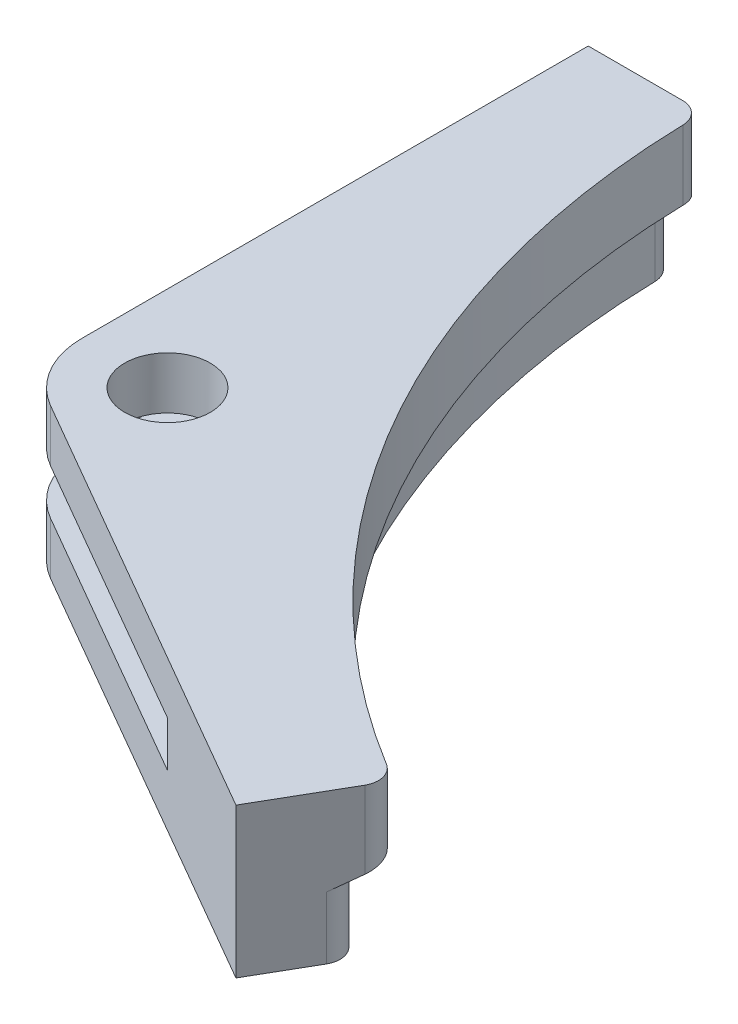
ISO-10303-21;
HEADER;
FILE_DESCRIPTION(('STEP AP214'),'2;1');
FILE_NAME('part.step','',(''),(''),'','','');
FILE_SCHEMA(('AUTOMOTIVE_DESIGN { 1 0 10303 214 1 1 1 1 }'));
ENDSEC;
DATA;
#1=APPLICATION_CONTEXT('core data for automotive mechanical design processes');
#2=APPLICATION_PROTOCOL_DEFINITION('international standard','automotive_design',2000,#1);
#3=PRODUCT_CONTEXT('',#1,'mechanical');
#4=PRODUCT('Part','Part','',(#3));
#5=PRODUCT_RELATED_PRODUCT_CATEGORY('part','',(#4));
#6=PRODUCT_DEFINITION_FORMATION('','',#4);
#7=PRODUCT_DEFINITION_CONTEXT('part definition',#1,'design');
#8=PRODUCT_DEFINITION('design','',#6,#7);
#9=PRODUCT_DEFINITION_SHAPE('','',#8);
#10=(LENGTH_UNIT() NAMED_UNIT(*) SI_UNIT(.MILLI.,.METRE.));
#11=(NAMED_UNIT(*) PLANE_ANGLE_UNIT() SI_UNIT($,.RADIAN.));
#12=(NAMED_UNIT(*) SI_UNIT($,.STERADIAN.) SOLID_ANGLE_UNIT());
#13=UNCERTAINTY_MEASURE_WITH_UNIT(LENGTH_MEASURE(1.E-05),#10,'distance_accuracy_value','');
#14=(GEOMETRIC_REPRESENTATION_CONTEXT(3) GLOBAL_UNCERTAINTY_ASSIGNED_CONTEXT((#13)) GLOBAL_UNIT_ASSIGNED_CONTEXT((#10,
#11,#12)) REPRESENTATION_CONTEXT('',''));
#15=CARTESIAN_POINT('',(0.,0.,0.));
#16=DIRECTION('',(0.,0.,1.));
#17=DIRECTION('',(1.,0.,0.));
#18=AXIS2_PLACEMENT_3D('',#15,#16,#17);
#19=CARTESIAN_POINT('',(8.00000000000001,-90.0000000000002,47.3427220735494));
#20=DIRECTION('',(0.,-1.,0.));
#21=DIRECTION('',(0.,0.,-1.));
#22=AXIS2_PLACEMENT_3D('',#19,#20,#21);
#23=CYLINDRICAL_SURFACE('',#22,8.);
#24=CARTESIAN_POINT('',(8.00000000000001,9.12500000000001,47.3427220735494));
#25=DIRECTION('',(0.,1.,0.));
#26=DIRECTION('',(-1.,0.,0.));
#27=AXIS2_PLACEMENT_3D('',#24,#25,#26);
#28=CIRCLE('',#27,8.);
#29=CARTESIAN_POINT('',(4.00000000000002,9.12500000000001,54.270925303825));
#30=VERTEX_POINT('',#29);
#31=CARTESIAN_POINT('',(0.,9.12500000000001,47.3427220735494));
#32=VERTEX_POINT('',#31);
#33=EDGE_CURVE('E194',#30,#32,#28,.F.);
#34=ORIENTED_EDGE('',*,*,#33,.F.);
#35=DIRECTION('',(0.,1.,0.));
#36=VECTOR('',#35,1.);
#37=CARTESIAN_POINT('',(4.00000000000002,0.,54.2709253038249));
#38=LINE('',#37,#36);
#39=CARTESIAN_POINT('',(4.00000000000002,14.,54.2709253038249));
#40=VERTEX_POINT('',#39);
#41=EDGE_CURVE('E256',#40,#30,#38,.F.);
#42=ORIENTED_EDGE('',*,*,#41,.F.);
#43=CARTESIAN_POINT('',(8.00000000000001,14.,47.3427220735494));
#44=DIRECTION('',(0.,-1.,0.));
#45=DIRECTION('',(0.,0.,-1.));
#46=AXIS2_PLACEMENT_3D('',#43,#44,#45);
#47=CIRCLE('',#46,8.);
#48=CARTESIAN_POINT('',(0.,14.,47.3427220735494));
#49=VERTEX_POINT('',#48);
#50=EDGE_CURVE('E253',#49,#40,#47,.F.);
#51=ORIENTED_EDGE('',*,*,#50,.F.);
#52=DIRECTION('',(0.,1.,0.));
#53=VECTOR('',#52,1.);
#54=CARTESIAN_POINT('',(0.,14.,47.3427220735494));
#55=LINE('',#54,#53);
#56=EDGE_CURVE('E251',#32,#49,#55,.T.);
#57=ORIENTED_EDGE('',*,*,#56,.F.);
#58=EDGE_LOOP('',(#34,#42,#51,#57));
#59=FACE_BOUND('',#58,.T.);
#60=ADVANCED_FACE('F52',(#59),#23,.T.);
#61=CARTESIAN_POINT('',(8.,0.,47.3427220735494));
#62=DIRECTION('',(0.,1.,0.));
#63=DIRECTION('',(0.,0.,1.));
#64=AXIS2_PLACEMENT_3D('',#61,#62,#63);
#65=CYLINDRICAL_SURFACE('',#64,4.00000000000001);
#66=CARTESIAN_POINT('',(8.,9.125,47.3427220735494));
#67=DIRECTION('',(0.,1.,0.));
#68=DIRECTION('',(-1.,0.,0.));
#69=AXIS2_PLACEMENT_3D('',#66,#67,#68);
#70=CIRCLE('',#69,4.00000000000001);
#71=CARTESIAN_POINT('',(3.99999999999999,9.125,47.3427220735494));
#72=VERTEX_POINT('',#71);
#73=EDGE_CURVE('E191',#72,#72,#70,.F.);
#74=ORIENTED_EDGE('',*,*,#73,.T.);
#75=EDGE_LOOP('',(#74));
#76=FACE_BOUND('',#75,.T.);
#77=CARTESIAN_POINT('',(8.,14.,47.3427220735494));
#78=DIRECTION('',(0.,1.,0.));
#79=DIRECTION('',(0.,0.,1.));
#80=AXIS2_PLACEMENT_3D('',#77,#78,#79);
#81=CIRCLE('',#80,4.00000000000001);
#82=CARTESIAN_POINT('',(8.,14.,51.3427220735494));
#83=VERTEX_POINT('',#82);
#84=EDGE_CURVE('E175',#83,#83,#81,.T.);
#85=ORIENTED_EDGE('',*,*,#84,.T.);
#86=EDGE_LOOP('',(#85));
#87=FACE_BOUND('',#86,.T.);
#88=ADVANCED_FACE('F348',(#76,#87),#65,.F.);
#89=CARTESIAN_POINT('',(50.4000000000002,14.,68.5892119797276));
#90=DIRECTION('',(0.,-1.,0.));
#91=DIRECTION('',(0.,0.,-1.));
#92=AXIS2_PLACEMENT_3D('',#89,#90,#91);
#93=PLANE('',#92);
#94=ORIENTED_EDGE('',*,*,#84,.F.);
#95=EDGE_LOOP('',(#94));
#96=FACE_BOUND('',#95,.T.);
#97=DIRECTION('',(-0.499999999999998,0.,0.86602540378444));
#98=VECTOR('',#97,1.);
#99=CARTESIAN_POINT('',(50.4000000000002,14.,68.5892119797276));
#100=LINE('',#99,#98);
#101=CARTESIAN_POINT('',(49.4123171393095,14.,70.2999288762088));
#102=VERTEX_POINT('',#101);
#103=CARTESIAN_POINT('',(45.0000000000002,14.,77.9422863405996));
#104=VERTEX_POINT('',#103);
#105=EDGE_CURVE('E228',#102,#104,#100,.T.);
#106=ORIENTED_EDGE('',*,*,#105,.F.);
#107=CARTESIAN_POINT('',(47.6802663317406,14.,69.2999288762088));
#108=DIRECTION('',(0.,-1.,0.));
#109=DIRECTION('',(0.,0.,-1.));
#110=AXIS2_PLACEMENT_3D('',#107,#108,#109);
#111=CIRCLE('',#110,2.);
#112=CARTESIAN_POINT('',(48.7226243038653,14.,67.5930340763022));
#113=VERTEX_POINT('',#112);
#114=EDGE_CURVE('E278',#102,#113,#111,.F.);
#115=ORIENTED_EDGE('',*,*,#114,.T.);
#116=CARTESIAN_POINT('',(90.,14.,0.));
#117=DIRECTION('',(0.,-1.,0.));
#118=DIRECTION('',(0.,0.,-1.));
#119=AXIS2_PLACEMENT_3D('',#116,#117,#118);
#120=CIRCLE('',#119,79.2);
#121=CARTESIAN_POINT('',(10.8240275229877,14.,1.95073891625616));
#122=VERTEX_POINT('',#121);
#123=EDGE_CURVE('E239',#113,#122,#120,.T.);
#124=ORIENTED_EDGE('',*,*,#123,.T.);
#125=CARTESIAN_POINT('',(8.82463427861874,14.,2.));
#126=DIRECTION('',(0.,-1.,0.));
#127=DIRECTION('',(0.,0.,-1.));
#128=AXIS2_PLACEMENT_3D('',#125,#126,#127);
#129=CIRCLE('',#128,2.);
#130=CARTESIAN_POINT('',(8.82463427861874,14.,0.));
#131=VERTEX_POINT('',#130);
#132=EDGE_CURVE('E276',#122,#131,#129,.F.);
#133=ORIENTED_EDGE('',*,*,#132,.T.);
#134=DIRECTION('',(-1.,0.,0.));
#135=VECTOR('',#134,1.);
#136=CARTESIAN_POINT('',(10.8,14.,0.));
#137=LINE('',#136,#135);
#138=CARTESIAN_POINT('',(0.,14.,0.));
#139=VERTEX_POINT('',#138);
#140=EDGE_CURVE('E215',#131,#139,#137,.T.);
#141=ORIENTED_EDGE('',*,*,#140,.T.);
#142=DIRECTION('',(0.,0.,1.));
#143=VECTOR('',#142,1.);
#144=CARTESIAN_POINT('',(0.,14.,0.));
#145=LINE('',#144,#143);
#146=EDGE_CURVE('E213',#139,#49,#145,.T.);
#147=ORIENTED_EDGE('',*,*,#146,.T.);
#148=ORIENTED_EDGE('',*,*,#50,.T.);
#149=DIRECTION('',(-0.86602540378444,0.,-0.499999999999998));
#150=VECTOR('',#149,1.);
#151=CARTESIAN_POINT('',(-22.5,14.,38.9711431702999));
#152=LINE('',#151,#150);
#153=EDGE_CURVE('E207',#104,#40,#152,.T.);
#154=ORIENTED_EDGE('',*,*,#153,.F.);
#155=EDGE_LOOP('',(#106,#115,#124,#133,#141,#147,#148,#154));
#156=FACE_BOUND('',#155,.T.);
#157=ADVANCED_FACE('F353',(#96,#156),#93,.F.);
#158=CARTESIAN_POINT('',(45.0000000000002,0.,77.9422863405996));
#159=DIRECTION('',(0.,1.,0.));
#160=DIRECTION('',(0.,0.,1.));
#161=AXIS2_PLACEMENT_3D('',#158,#159,#160);
#162=PLANE('',#161);
#163=CARTESIAN_POINT('',(8.,0.,47.3427220735494));
#164=DIRECTION('',(0.,1.,0.));
#165=DIRECTION('',(0.,0.,1.));
#166=AXIS2_PLACEMENT_3D('',#163,#164,#165);
#167=CIRCLE('',#166,4.00000000000001);
#168=CARTESIAN_POINT('',(8.,0.,51.3427220735494));
#169=VERTEX_POINT('',#168);
#170=EDGE_CURVE('E204',#169,#169,#167,.T.);
#171=ORIENTED_EDGE('',*,*,#170,.T.);
#172=EDGE_LOOP('',(#171));
#173=FACE_BOUND('',#172,.T.);
#174=CARTESIAN_POINT('',(90.,0.,0.));
#175=DIRECTION('',(0.,-1.,0.));
#176=DIRECTION('',(0.,0.,-1.));
#177=AXIS2_PLACEMENT_3D('',#174,#175,#176);
#178=CIRCLE('',#177,81.8275);
#179=CARTESIAN_POINT('',(47.4071696621184,0.,69.8683802593021));
#180=VERTEX_POINT('',#179);
#181=CARTESIAN_POINT('',(8.19579260523243,0.,1.95228296203513));
#182=VERTEX_POINT('',#181);
#183=EDGE_CURVE('E248',#180,#182,#178,.T.);
#184=ORIENTED_EDGE('',*,*,#183,.F.);
#185=CARTESIAN_POINT('',(46.3661301500257,0.,71.5760795110036));
#186=DIRECTION('',(0.,1.,0.));
#187=DIRECTION('',(0.,0.,1.));
#188=AXIS2_PLACEMENT_3D('',#185,#186,#187);
#189=CIRCLE('',#188,2.);
#190=CARTESIAN_POINT('',(48.0981809575946,0.,72.5760795110036));
#191=VERTEX_POINT('',#190);
#192=EDGE_CURVE('E274',#180,#191,#189,.F.);
#193=ORIENTED_EDGE('',*,*,#192,.T.);
#194=DIRECTION('',(0.499999999999998,0.,-0.86602540378444));
#195=VECTOR('',#194,1.);
#196=CARTESIAN_POINT('',(45.0000000000002,0.,77.9422863405996));
#197=LINE('',#196,#195);
#198=CARTESIAN_POINT('',(45.0000000000002,0.,77.9422863405996));
#199=VERTEX_POINT('',#198);
#200=EDGE_CURVE('E233',#199,#191,#197,.T.);
#201=ORIENTED_EDGE('',*,*,#200,.F.);
#202=DIRECTION('',(0.86602540378444,0.,0.499999999999998));
#203=VECTOR('',#202,1.);
#204=CARTESIAN_POINT('',(-22.5,0.,38.9711431702999));
#205=LINE('',#204,#203);
#206=CARTESIAN_POINT('',(4.00000000000002,0.,54.2709253038249));
#207=VERTEX_POINT('',#206);
#208=EDGE_CURVE('E212',#207,#199,#205,.T.);
#209=ORIENTED_EDGE('',*,*,#208,.F.);
#210=CARTESIAN_POINT('',(8.00000000000001,0.,47.3427220735494));
#211=DIRECTION('',(0.,1.,0.));
#212=DIRECTION('',(0.,0.,1.));
#213=AXIS2_PLACEMENT_3D('',#210,#211,#212);
#214=CIRCLE('',#213,8.);
#215=CARTESIAN_POINT('',(0.,0.,47.3427220735494));
#216=VERTEX_POINT('',#215);
#217=EDGE_CURVE('E259',#207,#216,#214,.F.);
#218=ORIENTED_EDGE('',*,*,#217,.T.);
#219=DIRECTION('',(0.,0.,-1.));
#220=VECTOR('',#219,1.);
#221=CARTESIAN_POINT('',(0.,0.,0.));
#222=LINE('',#221,#220);
#223=CARTESIAN_POINT('',(0.,0.,0.));
#224=VERTEX_POINT('',#223);
#225=EDGE_CURVE('E210',#216,#224,#222,.T.);
#226=ORIENTED_EDGE('',*,*,#225,.T.);
#227=DIRECTION('',(1.,0.,0.));
#228=VECTOR('',#227,1.);
#229=CARTESIAN_POINT('',(0.,0.,0.));
#230=LINE('',#229,#228);
#231=CARTESIAN_POINT('',(6.19636191518892,0.,0.));
#232=VERTEX_POINT('',#231);
#233=EDGE_CURVE('E224',#224,#232,#230,.T.);
#234=ORIENTED_EDGE('',*,*,#233,.T.);
#235=CARTESIAN_POINT('',(6.19636191518892,0.,2.));
#236=DIRECTION('',(0.,1.,0.));
#237=DIRECTION('',(0.,0.,1.));
#238=AXIS2_PLACEMENT_3D('',#235,#236,#237);
#239=CIRCLE('',#238,2.);
#240=EDGE_CURVE('E272',#232,#182,#239,.F.);
#241=ORIENTED_EDGE('',*,*,#240,.T.);
#242=EDGE_LOOP('',(#184,#193,#201,#209,#218,#226,#234,#241));
#243=FACE_BOUND('',#242,.T.);
#244=ADVANCED_FACE('F387',(#173,#243),#162,.F.);
#245=CARTESIAN_POINT('',(90.,0.,0.));
#246=DIRECTION('',(0.,-1.,0.));
#247=DIRECTION('',(0.,0.,-1.));
#248=AXIS2_PLACEMENT_3D('',#245,#246,#247);
#249=CYLINDRICAL_SURFACE('',#248,81.8275);
#250=CARTESIAN_POINT('',(90.,6.544,0.));
#251=DIRECTION('',(0.,-1.,0.));
#252=DIRECTION('',(0.,0.,-1.));
#253=AXIS2_PLACEMENT_3D('',#250,#251,#252);
#254=CIRCLE('',#253,81.8275);
#255=CARTESIAN_POINT('',(47.4071696621184,6.544,69.8683802593021));
#256=VERTEX_POINT('',#255);
#257=CARTESIAN_POINT('',(8.19579260523243,6.544,1.95228296203513));
#258=VERTEX_POINT('',#257);
#259=EDGE_CURVE('E245',#256,#258,#254,.T.);
#260=ORIENTED_EDGE('',*,*,#259,.F.);
#261=DIRECTION('',(0.,-1.,0.));
#262=VECTOR('',#261,1.);
#263=CARTESIAN_POINT('',(47.4071696621184,0.,69.8683802593021));
#264=LINE('',#263,#262);
#265=EDGE_CURVE('E270',#256,#180,#264,.T.);
#266=ORIENTED_EDGE('',*,*,#265,.T.);
#267=ORIENTED_EDGE('',*,*,#183,.T.);
#268=DIRECTION('',(0.,-1.,0.));
#269=VECTOR('',#268,1.);
#270=CARTESIAN_POINT('',(8.19579260523243,0.,1.95228296203513));
#271=LINE('',#270,#269);
#272=EDGE_CURVE('E267',#182,#258,#271,.F.);
#273=ORIENTED_EDGE('',*,*,#272,.T.);
#274=EDGE_LOOP('',(#260,#266,#267,#273));
#275=FACE_BOUND('',#274,.T.);
#276=ADVANCED_FACE('F305',(#275),#249,.F.);
#277=CARTESIAN_POINT('',(90.,6.544,0.));
#278=DIRECTION('',(0.,-1.,0.));
#279=DIRECTION('',(0.,0.,-1.));
#280=AXIS2_PLACEMENT_3D('',#277,#278,#279);
#281=CONICAL_SURFACE('',#280,81.8275,1.2218419855509);
#282=CARTESIAN_POINT('',(90.,7.5,0.));
#283=DIRECTION('',(0.,-1.,0.));
#284=DIRECTION('',(0.,0.,-1.));
#285=AXIS2_PLACEMENT_3D('',#282,#283,#284);
#286=CIRCLE('',#285,79.2);
#287=CARTESIAN_POINT('',(48.7226243038653,7.5,67.5930340763022));
#288=VERTEX_POINT('',#287);
#289=CARTESIAN_POINT('',(10.8240275229877,7.5,1.95073891625616));
#290=VERTEX_POINT('',#289);
#291=EDGE_CURVE('E242',#288,#290,#286,.T.);
#292=ORIENTED_EDGE('',*,*,#291,.F.);
#293=CARTESIAN_POINT('',(48.7226243038653,7.5,67.5930340763022));
#294=CARTESIAN_POINT('',(48.7684677032122,7.50000279834903,67.6210211471057));
#295=CARTESIAN_POINT('',(48.8131729255983,7.49919293303445,67.6508649180195));
#296=CARTESIAN_POINT('',(48.8999962547022,7.49596932642111,67.7140119345406));
#297=CARTESIAN_POINT('',(48.9421148233491,7.49355587240917,67.7473145595844));
#298=CARTESIAN_POINT('',(49.0233701425184,7.48715444932095,67.8170492432722));
#299=CARTESIAN_POINT('',(49.0625140083034,7.48317038810106,67.8534733605677));
#300=CARTESIAN_POINT('',(49.1376655244209,7.47367271569451,67.9292216954279));
#301=CARTESIAN_POINT('',(49.17367313319,7.4681590842412,67.968545951414));
#302=CARTESIAN_POINT('',(49.2766225762036,7.44940044243339,68.0904144877216));
#303=CARTESIAN_POINT('',(49.3385774662921,7.43393076137531,68.1769290452558));
#304=CARTESIAN_POINT('',(49.4476223001928,7.3976580188263,68.3577882964963));
#305=CARTESIAN_POINT('',(49.494707549634,7.37685327679609,68.452135451119));
#306=CARTESIAN_POINT('',(49.574296163747,7.33000487001192,68.6486392944524));
#307=CARTESIAN_POINT('',(49.6063774405637,7.30383635438902,68.7509371062205));
#308=CARTESIAN_POINT('',(49.6537374062927,7.24747560821267,68.958269872327));
#309=CARTESIAN_POINT('',(49.6690110807229,7.21728217985288,69.0633056339592));
#310=CARTESIAN_POINT('',(49.6832774042101,7.15184815266197,69.2797936651194));
#311=CARTESIAN_POINT('',(49.6812435258246,7.11641384081231,69.3912546048681));
#312=CARTESIAN_POINT('',(49.658947076771,7.04303253799242,69.6114960462421));
#313=CARTESIAN_POINT('',(49.6386829378979,7.00508533111787,69.7202763164435));
#314=CARTESIAN_POINT('',(49.5870882163913,6.93612538750001,69.9093876727117));
#315=CARTESIAN_POINT('',(49.5591221107706,6.90539901645429,69.9907615086386));
#316=CARTESIAN_POINT('',(49.493127330611,6.84354146954079,70.148975205689));
#317=CARTESIAN_POINT('',(49.4551159113968,6.81241107405785,70.2258225679523));
#318=CARTESIAN_POINT('',(49.4123171393095,6.78127511716822,70.2999288762088));
#319=B_SPLINE_CURVE_WITH_KNOTS('',3,(#293,#294,#295,#296,#297,#298,#299,#300,#301,#302,#303,
#304,#305,#306,#307,#308,#309,#310,#311,#312,#313,#314,#315,#316,#317,#318),.UNSPECIFIED.,.F.,
.F.,(4,2,2,2,2,2,2,2,2,2,2,2,4),(0.,0.161077295221845,0.322125740832137,0.482775982603922,
0.643428353076023,0.964394437206369,1.28546174981866,1.61508625062153,1.94480906696059,
2.2942184020792,2.64365779699458,2.91711336926233,3.19010223280675),.UNSPECIFIED.);
#320=CARTESIAN_POINT('',(49.4123171393095,6.78127511716822,70.2999288762088));
#321=VERTEX_POINT('',#320);
#322=EDGE_CURVE('E292',#288,#321,#319,.T.);
#323=ORIENTED_EDGE('',*,*,#322,.T.);
#324=DIRECTION('',(0.469865376660376,0.341915356869513,-0.813830705093263));
#325=VECTOR('',#324,1.);
#326=CARTESIAN_POINT('',(49.0862500000002,6.544,70.8646937281712));
#327=LINE('',#326,#325);
#328=CARTESIAN_POINT('',(48.0981809575946,5.82499409740079,72.5760795110036));
#329=VERTEX_POINT('',#328);
#330=EDGE_CURVE('E236',#329,#321,#327,.T.);
#331=ORIENTED_EDGE('',*,*,#330,.F.);
#332=CARTESIAN_POINT('',(48.0981809575946,5.82499409740079,72.5760795110036));
#333=CARTESIAN_POINT('',(48.1276806747442,5.84646213450947,72.524979447164));
#334=CARTESIAN_POINT('',(48.1549084283947,5.86792042123154,72.4725995728436));
#335=CARTESIAN_POINT('',(48.2046533006139,5.91068969168891,72.3655856483618));
#336=CARTESIAN_POINT('',(48.227170037957,5.93200066336834,72.310951416201));
#337=CARTESIAN_POINT('',(48.287410885463,5.99553029732635,72.1440997002233));
#338=CARTESIAN_POINT('',(48.3178049827625,6.03733064358997,72.0289689855904));
#339=CARTESIAN_POINT('',(48.3577687301815,6.11852496789642,71.7942186374971));
#340=CARTESIAN_POINT('',(48.3673148064392,6.15791617295818,71.6745940778755));
#341=CARTESIAN_POINT('',(48.3647131133498,6.23296184866063,71.4344485963288));
#342=CARTESIAN_POINT('',(48.3525816946278,6.2686191142167,71.3139284182145));
#343=CARTESIAN_POINT('',(48.3070887473767,6.33382809422749,71.0796365169869));
#344=CARTESIAN_POINT('',(48.2744348369934,6.36354140446147,70.9657730121578));
#345=CARTESIAN_POINT('',(48.1888623207139,6.41712115781002,70.7443860217422));
#346=CARTESIAN_POINT('',(48.1359430634075,6.44098741293611,70.6368627400844));
#347=CARTESIAN_POINT('',(48.0149141598562,6.48053983144706,70.4384601022636));
#348=CARTESIAN_POINT('',(47.9479529005887,6.4966421765759,70.3469616634661));
#349=CARTESIAN_POINT('',(47.7989895996916,6.52206180923507,70.1761877756468));
#350=CARTESIAN_POINT('',(47.7170140788517,6.53139091881472,70.0968912210082));
#351=CARTESIAN_POINT('',(47.5937461074477,6.53941905161209,69.9965146971311));
#352=CARTESIAN_POINT('',(47.5576392759519,6.54113680391443,69.9691055565938));
#353=CARTESIAN_POINT('',(47.4836828987248,6.5434260281611,69.9168273125778));
#354=CARTESIAN_POINT('',(47.4458362149056,6.54399931817342,69.8919542401097));
#355=CARTESIAN_POINT('',(47.4071696621184,6.544,69.8683802593021));
#356=B_SPLINE_CURVE_WITH_KNOTS('',3,(#332,#333,#334,#335,#336,#337,#338,#339,#340,#341,#342,
#343,#344,#345,#346,#347,#348,#349,#350,#351,#352,#353,#354,#355),.UNSPECIFIED.,.F.,.F.,(4,2,2,
2,2,2,2,2,2,2,2,4),(0.,0.188250833488881,0.376516894748757,0.753179284106977,1.13026736373196,
1.50707113820628,1.87154621695716,2.23603301239781,2.57786867495482,2.91910625150215,
3.05510381065821,3.19088515457276),.UNSPECIFIED.);
#357=EDGE_CURVE('E314',#329,#256,#356,.T.);
#358=ORIENTED_EDGE('',*,*,#357,.T.);
#359=ORIENTED_EDGE('',*,*,#259,.T.);
#360=CARTESIAN_POINT('',(8.19579260523243,6.544,1.95228296203513));
#361=CARTESIAN_POINT('',(8.19451818170569,6.54400279062143,1.8985838253052));
#362=CARTESIAN_POINT('',(8.19106643532391,6.54319347945187,1.84494035050971));
#363=CARTESIAN_POINT('',(8.17987249648514,6.53997204724225,1.73816084947656));
#364=CARTESIAN_POINT('',(8.17213107136654,6.53756021284642,1.6850247342111));
#365=CARTESIAN_POINT('',(8.1524458122232,6.53116302317057,1.57976673520507));
#366=CARTESIAN_POINT('',(8.14051240421992,6.52718156876847,1.52764267069609));
#367=CARTESIAN_POINT('',(8.11256437709493,6.51768999544875,1.42465742269708));
#368=CARTESIAN_POINT('',(8.09654970413649,6.51217985636587,1.37379625587589));
#369=CARTESIAN_POINT('',(8.04259232950247,6.49343280617052,1.22365396438137));
#370=CARTESIAN_POINT('',(7.99871507626749,6.47797235255922,1.12670205408116));
#371=CARTESIAN_POINT('',(7.89673761443534,6.44171975344246,0.94174661412134));
#372=CARTESIAN_POINT('',(7.83863293365673,6.42092593137371,0.853745910476057));
#373=CARTESIAN_POINT('',(7.70836328740521,6.37410104448006,0.686462828345705));
#374=CARTESIAN_POINT('',(7.63586538409083,6.34794536424327,0.607474680282135));
#375=CARTESIAN_POINT('',(7.48008713563924,6.29160959100507,0.462674553663485));
#376=CARTESIAN_POINT('',(7.39680359686087,6.26142830593712,0.396866492505835));
#377=CARTESIAN_POINT('',(7.21653765878011,6.19601991996273,0.276138228936269));
#378=CARTESIAN_POINT('',(7.11903455512533,6.16059926311713,0.22210114459129));
#379=CARTESIAN_POINT('',(6.91722390840686,6.08724229476846,0.131147710921421));
#380=CARTESIAN_POINT('',(6.81291574672914,6.04930575455374,0.0942329205798023));
#381=CARTESIAN_POINT('',(6.62314823883469,5.98027456413643,0.0441613111129402));
#382=CARTESIAN_POINT('',(6.53846333876716,5.94946445326489,0.027601311180171));
#383=CARTESIAN_POINT('',(6.36797806347395,5.88743558221941,0.00552407003589066));
#384=CARTESIAN_POINT('',(6.28217982998693,5.85621760604348,-1.19014205600791E-05));
#385=CARTESIAN_POINT('',(6.19636191518893,5.82499409740079,0.));
#386=B_SPLINE_CURVE_WITH_KNOTS('',3,(#360,#361,#362,#363,#364,#365,#366,#367,#368,#369,#370,
#371,#372,#373,#374,#375,#376,#377,#378,#379,#380,#381,#382,#383,#384,#385),.UNSPECIFIED.,.F.,
.F.,(4,2,2,2,2,2,2,2,2,2,2,2,4),(0.,0.161086461856532,0.322144117840224,0.482804005401755,
0.643466012367622,0.964451776902749,1.28553856838432,1.61516763895899,1.94489453726543,
2.2942809192712,2.6436991066329,2.91792126868084,3.19167711793178),.UNSPECIFIED.);
#387=CARTESIAN_POINT('',(6.19636191518892,5.8249940974008,0.));
#388=VERTEX_POINT('',#387);
#389=EDGE_CURVE('E61',#258,#388,#386,.T.);
#390=ORIENTED_EDGE('',*,*,#389,.T.);
#391=DIRECTION('',(0.939730753320755,0.341915356869513,0.));
#392=VECTOR('',#391,1.);
#393=CARTESIAN_POINT('',(8.1725,6.544,0.));
#394=LINE('',#393,#392);
#395=CARTESIAN_POINT('',(8.82463427861874,6.78127511716823,0.));
#396=VERTEX_POINT('',#395);
#397=EDGE_CURVE('E68',#388,#396,#394,.T.);
#398=ORIENTED_EDGE('',*,*,#397,.T.);
#399=CARTESIAN_POINT('',(8.82463427861874,6.78127511716823,0.));
#400=CARTESIAN_POINT('',(8.88363765737776,6.80274299199174,2.52773508467373E-06));
#401=CARTESIAN_POINT('',(8.94261339977561,6.82420112520935,0.00261249965732106));
#402=CARTESIAN_POINT('',(9.0601617589986,6.86697007516429,0.0130389860222849));
#403=CARTESIAN_POINT('',(9.11873434280699,6.88828087983673,0.0208559218834359));
#404=CARTESIAN_POINT('',(9.29335164290199,6.95181003352891,0.052111271632549));
#405=CARTESIAN_POINT('',(9.40825433312331,6.99360999384238,0.0833542152680843));
#406=CARTESIAN_POINT('',(9.63153543384585,7.0748026393279,0.166119045582111));
#407=CARTESIAN_POINT('',(9.73990632206952,7.11419254975329,0.21766381687262));
#408=CARTESIAN_POINT('',(9.94657794678371,7.1892334207388,0.339989283736567));
#409=CARTESIAN_POINT('',(10.0448862230256,7.22488718121832,0.410755429611021));
#410=CARTESIAN_POINT('',(10.2250417024839,7.29008465860347,0.567298192691992));
#411=CARTESIAN_POINT('',(10.3073224924272,7.31979021156509,0.652507456277001));
#412=CARTESIAN_POINT('',(10.4562621147104,7.37334940533534,0.837306188056693));
#413=CARTESIAN_POINT('',(10.5229204238913,7.39720285017229,0.936896137645287));
#414=CARTESIAN_POINT('',(10.6342245893164,7.4367227744065,1.14090295887499));
#415=CARTESIAN_POINT('',(10.6799818283371,7.45280623537926,1.24463417473153));
#416=CARTESIAN_POINT('',(10.7533929148629,7.47818244663423,1.45900918850148));
#417=CARTESIAN_POINT('',(10.7810784243964,7.48748707690245,1.5696405225595));
#418=CARTESIAN_POINT('',(10.8063373491988,7.49546518483086,1.72632763562975));
#419=CARTESIAN_POINT('',(10.8119997245921,7.49716565065086,1.77105548831331));
#420=CARTESIAN_POINT('',(10.8202867487638,7.49943181066028,1.8607485011209));
#421=CARTESIAN_POINT('',(10.8229162154396,7.49999930567063,1.90571317056966));
#422=CARTESIAN_POINT('',(10.8240275229878,7.50000000000001,1.95073891625615));
#423=B_SPLINE_CURVE_WITH_KNOTS('',3,(#399,#400,#401,#402,#403,#404,#405,#406,#407,#408,#409,
#410,#411,#412,#413,#414,#415,#416,#417,#418,#419,#420,#421,#422),.UNSPECIFIED.,.F.,.F.,(4,2,2,
2,2,2,2,2,2,2,2,4),(0.,0.188249447148653,0.376514131857364,0.753174577381141,1.13026082255917,
1.50706242240043,1.87152646332895,2.23600270753214,2.57780591162411,2.91900865084021,
3.05426591833371,3.18930802700959),.UNSPECIFIED.);
#424=EDGE_CURVE('E285',#396,#290,#423,.T.);
#425=ORIENTED_EDGE('',*,*,#424,.T.);
#426=EDGE_LOOP('',(#292,#323,#331,#358,#359,#390,#398,#425));
#427=FACE_BOUND('',#426,.T.);
#428=ADVANCED_FACE('F299',(#427),#281,.F.);
#429=CARTESIAN_POINT('',(90.,0.,0.));
#430=DIRECTION('',(0.,-1.,0.));
#431=DIRECTION('',(0.,0.,-1.));
#432=AXIS2_PLACEMENT_3D('',#429,#430,#431);
#433=CYLINDRICAL_SURFACE('',#432,79.2);
#434=ORIENTED_EDGE('',*,*,#123,.F.);
#435=DIRECTION('',(0.,-1.,0.));
#436=VECTOR('',#435,1.);
#437=CARTESIAN_POINT('',(48.7226243038653,0.,67.5930340763022));
#438=LINE('',#437,#436);
#439=EDGE_CURVE('E283',#113,#288,#438,.T.);
#440=ORIENTED_EDGE('',*,*,#439,.T.);
#441=ORIENTED_EDGE('',*,*,#291,.T.);
#442=DIRECTION('',(0.,-1.,0.));
#443=VECTOR('',#442,1.);
#444=CARTESIAN_POINT('',(10.8240275229877,0.,1.95073891625616));
#445=LINE('',#444,#443);
#446=EDGE_CURVE('E280',#290,#122,#445,.F.);
#447=ORIENTED_EDGE('',*,*,#446,.T.);
#448=EDGE_LOOP('',(#434,#440,#441,#447));
#449=FACE_BOUND('',#448,.T.);
#450=ADVANCED_FACE('F304',(#449),#433,.F.);
#451=CARTESIAN_POINT('',(45.0000000000002,0.,77.9422863405996));
#452=DIRECTION('',(0.86602540378444,0.,0.499999999999998));
#453=DIRECTION('',(0.499999999999998,0.,-0.86602540378444));
#454=AXIS2_PLACEMENT_3D('',#451,#452,#453);
#455=PLANE('',#454);
#456=ORIENTED_EDGE('',*,*,#200,.T.);
#457=DIRECTION('',(0.,1.,0.));
#458=VECTOR('',#457,1.);
#459=CARTESIAN_POINT('',(48.0981809575946,6.544,72.5760795110036));
#460=LINE('',#459,#458);
#461=EDGE_CURVE('E264',#191,#329,#460,.T.);
#462=ORIENTED_EDGE('',*,*,#461,.T.);
#463=ORIENTED_EDGE('',*,*,#330,.T.);
#464=DIRECTION('',(0.,1.,0.));
#465=VECTOR('',#464,1.);
#466=CARTESIAN_POINT('',(49.4123171393095,14.,70.2999288762088));
#467=LINE('',#466,#465);
#468=EDGE_CURVE('E261',#321,#102,#467,.T.);
#469=ORIENTED_EDGE('',*,*,#468,.T.);
#470=ORIENTED_EDGE('',*,*,#105,.T.);
#471=DIRECTION('',(0.,-1.,0.));
#472=VECTOR('',#471,1.);
#473=CARTESIAN_POINT('',(45.0000000000002,14.,77.9422863405996));
#474=LINE('',#473,#472);
#475=EDGE_CURVE('E230',#104,#199,#474,.T.);
#476=ORIENTED_EDGE('',*,*,#475,.T.);
#477=EDGE_LOOP('',(#456,#462,#463,#469,#470,#476));
#478=FACE_BOUND('',#477,.T.);
#479=ADVANCED_FACE('F397',(#478),#455,.T.);
#480=CARTESIAN_POINT('',(0.,0.,0.));
#481=DIRECTION('',(0.,0.,1.));
#482=DIRECTION('',(1.,0.,0.));
#483=AXIS2_PLACEMENT_3D('',#480,#481,#482);
#484=PLANE('',#483);
#485=ORIENTED_EDGE('',*,*,#397,.F.);
#486=DIRECTION('',(0.,-1.,0.));
#487=VECTOR('',#486,1.);
#488=CARTESIAN_POINT('',(6.19636191518892,0.,0.));
#489=LINE('',#488,#487);
#490=EDGE_CURVE('E321',#388,#232,#489,.T.);
#491=ORIENTED_EDGE('',*,*,#490,.T.);
#492=ORIENTED_EDGE('',*,*,#233,.F.);
#493=DIRECTION('',(0.,-1.,0.));
#494=VECTOR('',#493,1.);
#495=CARTESIAN_POINT('',(0.,14.,0.));
#496=LINE('',#495,#494);
#497=EDGE_CURVE('E221',#139,#224,#496,.T.);
#498=ORIENTED_EDGE('',*,*,#497,.F.);
#499=ORIENTED_EDGE('',*,*,#140,.F.);
#500=DIRECTION('',(0.,-1.,0.));
#501=VECTOR('',#500,1.);
#502=CARTESIAN_POINT('',(8.82463427861874,0.,0.));
#503=LINE('',#502,#501);
#504=EDGE_CURVE('E73',#131,#396,#503,.T.);
#505=ORIENTED_EDGE('',*,*,#504,.T.);
#506=EDGE_LOOP('',(#485,#491,#492,#498,#499,#505));
#507=FACE_BOUND('',#506,.T.);
#508=ADVANCED_FACE('F383',(#507),#484,.F.);
#509=CARTESIAN_POINT('',(0.,-90.0000000000002,0.));
#510=DIRECTION('',(-1.,0.,0.));
#511=DIRECTION('',(0.,0.,1.));
#512=AXIS2_PLACEMENT_3D('',#509,#510,#511);
#513=PLANE('',#512);
#514=DIRECTION('',(0.,0.,-1.));
#515=VECTOR('',#514,1.);
#516=CARTESIAN_POINT('',(0.,9.12500000000001,0.));
#517=LINE('',#516,#515);
#518=CARTESIAN_POINT('',(0.,9.125,17.4863156129985));
#519=VERTEX_POINT('',#518);
#520=EDGE_CURVE('E176',#32,#519,#517,.T.);
#521=ORIENTED_EDGE('',*,*,#520,.F.);
#522=ORIENTED_EDGE('',*,*,#56,.T.);
#523=ORIENTED_EDGE('',*,*,#146,.F.);
#524=ORIENTED_EDGE('',*,*,#497,.T.);
#525=ORIENTED_EDGE('',*,*,#225,.F.);
#526=CARTESIAN_POINT('',(0.,4.87500000000001,47.3427220735494));
#527=VERTEX_POINT('',#526);
#528=EDGE_CURVE('E190',#216,#527,#55,.T.);
#529=ORIENTED_EDGE('',*,*,#528,.T.);
#530=DIRECTION('',(0.,0.,1.));
#531=VECTOR('',#530,1.);
#532=CARTESIAN_POINT('',(0.,4.875,0.));
#533=LINE('',#532,#531);
#534=CARTESIAN_POINT('',(0.,4.875,17.4863156129985));
#535=VERTEX_POINT('',#534);
#536=EDGE_CURVE('E181',#535,#527,#533,.T.);
#537=ORIENTED_EDGE('',*,*,#536,.F.);
#538=DIRECTION('',(0.,-1.,0.));
#539=VECTOR('',#538,1.);
#540=CARTESIAN_POINT('',(0.,-90.0000000000002,17.4863156129985));
#541=LINE('',#540,#539);
#542=EDGE_CURVE('E166',#519,#535,#541,.T.);
#543=ORIENTED_EDGE('',*,*,#542,.F.);
#544=EDGE_LOOP('',(#521,#522,#523,#524,#525,#529,#537,#543));
#545=FACE_BOUND('',#544,.T.);
#546=ADVANCED_FACE('F187',(#545),#513,.T.);
#547=CARTESIAN_POINT('',(-22.5,-90.0000000000002,38.9711431702999));
#548=DIRECTION('',(0.499999999999998,0.,-0.86602540378444));
#549=DIRECTION('',(-0.86602540378444,0.,-0.499999999999998));
#550=AXIS2_PLACEMENT_3D('',#547,#548,#549);
#551=PLANE('',#550);
#552=ORIENTED_EDGE('',*,*,#41,.T.);
#553=DIRECTION('',(0.86602540378444,0.,0.499999999999998));
#554=VECTOR('',#553,1.);
#555=CARTESIAN_POINT('',(-22.5,9.12500000000001,38.9711431702999));
#556=LINE('',#555,#554);
#557=CARTESIAN_POINT('',(29.856406460551,9.125,69.1991285341003));
#558=VERTEX_POINT('',#557);
#559=EDGE_CURVE('E200',#30,#558,#556,.T.);
#560=ORIENTED_EDGE('',*,*,#559,.T.);
#561=DIRECTION('',(0.,-1.,0.));
#562=VECTOR('',#561,1.);
#563=CARTESIAN_POINT('',(29.8564064605509,-90.0000000000002,69.1991285341003));
#564=LINE('',#563,#562);
#565=CARTESIAN_POINT('',(29.856406460551,4.875,69.1991285341003));
#566=VERTEX_POINT('',#565);
#567=EDGE_CURVE('E12',#558,#566,#564,.T.);
#568=ORIENTED_EDGE('',*,*,#567,.T.);
#569=DIRECTION('',(-0.86602540378444,0.,-0.499999999999998));
#570=VECTOR('',#569,1.);
#571=CARTESIAN_POINT('',(-22.5,4.875,38.9711431702999));
#572=LINE('',#571,#570);
#573=CARTESIAN_POINT('',(4.00000000000002,4.87500000000001,54.270925303825));
#574=VERTEX_POINT('',#573);
#575=EDGE_CURVE('E184',#566,#574,#572,.T.);
#576=ORIENTED_EDGE('',*,*,#575,.T.);
#577=EDGE_CURVE('E255',#574,#207,#38,.F.);
#578=ORIENTED_EDGE('',*,*,#577,.T.);
#579=ORIENTED_EDGE('',*,*,#208,.T.);
#580=ORIENTED_EDGE('',*,*,#475,.F.);
#581=ORIENTED_EDGE('',*,*,#153,.T.);
#582=EDGE_LOOP('',(#552,#560,#568,#576,#578,#579,#580,#581));
#583=FACE_BOUND('',#582,.T.);
#584=ADVANCED_FACE('F357',(#583),#551,.F.);
#585=CARTESIAN_POINT('',(8.00000000000001,4.875,47.3427220735494));
#586=DIRECTION('',(0.,-1.,0.));
#587=DIRECTION('',(1.,0.,0.));
#588=AXIS2_PLACEMENT_3D('',#585,#586,#587);
#589=CIRCLE('',#588,8.);
#590=EDGE_CURVE('E195',#527,#574,#589,.F.);
#591=ORIENTED_EDGE('',*,*,#590,.F.);
#592=ORIENTED_EDGE('',*,*,#528,.F.);
#593=ORIENTED_EDGE('',*,*,#217,.F.);
#594=ORIENTED_EDGE('',*,*,#577,.F.);
#595=EDGE_LOOP('',(#591,#592,#593,#594));
#596=FACE_BOUND('',#595,.T.);
#597=ADVANCED_FACE('F332',(#596),#23,.T.);
#598=CARTESIAN_POINT('',(46.3661301500257,0.,71.5760795110036));
#599=DIRECTION('',(0.,-1.,0.));
#600=DIRECTION('',(0.,0.,-1.));
#601=AXIS2_PLACEMENT_3D('',#598,#599,#600);
#602=CYLINDRICAL_SURFACE('',#601,2.);
#603=ORIENTED_EDGE('',*,*,#192,.F.);
#604=ORIENTED_EDGE('',*,*,#265,.F.);
#605=ORIENTED_EDGE('',*,*,#357,.F.);
#606=ORIENTED_EDGE('',*,*,#461,.F.);
#607=EDGE_LOOP('',(#603,#604,#605,#606));
#608=FACE_BOUND('',#607,.T.);
#609=ADVANCED_FACE('F327',(#608),#602,.T.);
#610=CARTESIAN_POINT('',(47.6802663317406,0.,69.2999288762088));
#611=DIRECTION('',(0.,-1.,0.));
#612=DIRECTION('',(0.,0.,-1.));
#613=AXIS2_PLACEMENT_3D('',#610,#611,#612);
#614=CYLINDRICAL_SURFACE('',#613,2.);
#615=ORIENTED_EDGE('',*,*,#322,.F.);
#616=ORIENTED_EDGE('',*,*,#439,.F.);
#617=ORIENTED_EDGE('',*,*,#114,.F.);
#618=ORIENTED_EDGE('',*,*,#468,.F.);
#619=EDGE_LOOP('',(#615,#616,#617,#618));
#620=FACE_BOUND('',#619,.T.);
#621=ADVANCED_FACE('F331',(#620),#614,.T.);
#622=CARTESIAN_POINT('',(6.19636191518892,0.,2.));
#623=DIRECTION('',(0.,-1.,0.));
#624=DIRECTION('',(0.,0.,-1.));
#625=AXIS2_PLACEMENT_3D('',#622,#623,#624);
#626=CYLINDRICAL_SURFACE('',#625,2.);
#627=ORIENTED_EDGE('',*,*,#240,.F.);
#628=ORIENTED_EDGE('',*,*,#490,.F.);
#629=ORIENTED_EDGE('',*,*,#389,.F.);
#630=ORIENTED_EDGE('',*,*,#272,.F.);
#631=EDGE_LOOP('',(#627,#628,#629,#630));
#632=FACE_BOUND('',#631,.T.);
#633=ADVANCED_FACE('F336',(#632),#626,.T.);
#634=CARTESIAN_POINT('',(8.82463427861874,0.,2.));
#635=DIRECTION('',(0.,-1.,0.));
#636=DIRECTION('',(0.,0.,-1.));
#637=AXIS2_PLACEMENT_3D('',#634,#635,#636);
#638=CYLINDRICAL_SURFACE('',#637,2.);
#639=ORIENTED_EDGE('',*,*,#424,.F.);
#640=ORIENTED_EDGE('',*,*,#504,.F.);
#641=ORIENTED_EDGE('',*,*,#132,.F.);
#642=ORIENTED_EDGE('',*,*,#446,.F.);
#643=EDGE_LOOP('',(#639,#640,#641,#642));
#644=FACE_BOUND('',#643,.T.);
#645=ADVANCED_FACE('F54',(#644),#638,.T.);
#646=CARTESIAN_POINT('',(8.,4.875,47.3427220735494));
#647=DIRECTION('',(0.,-1.,0.));
#648=DIRECTION('',(1.,0.,0.));
#649=AXIS2_PLACEMENT_3D('',#646,#647,#648);
#650=CIRCLE('',#649,4.00000000000001);
#651=CARTESIAN_POINT('',(12.,4.875,47.3427220735494));
#652=VERTEX_POINT('',#651);
#653=EDGE_CURVE('E366',#652,#652,#650,.F.);
#654=ORIENTED_EDGE('',*,*,#653,.T.);
#655=EDGE_LOOP('',(#654));
#656=FACE_BOUND('',#655,.T.);
#657=ORIENTED_EDGE('',*,*,#170,.F.);
#658=EDGE_LOOP('',(#657));
#659=FACE_BOUND('',#658,.T.);
#660=ADVANCED_FACE('F344',(#656,#659),#65,.F.);
#661=CARTESIAN_POINT('',(-7.57179676972458,4.875,4.37157890324962));
#662=DIRECTION('',(0.866025403784438,0.,-0.500000000000001));
#663=DIRECTION('',(-0.500000000000001,0.,-0.866025403784438));
#664=AXIS2_PLACEMENT_3D('',#661,#662,#663);
#665=PLANE('',#664);
#666=ORIENTED_EDGE('',*,*,#542,.T.);
#667=DIRECTION('',(0.500000000000001,0.,0.866025403784438));
#668=VECTOR('',#667,1.);
#669=CARTESIAN_POINT('',(-7.57179676972458,4.875,4.37157890324962));
#670=LINE('',#669,#668);
#671=EDGE_CURVE('E169',#535,#566,#670,.T.);
#672=ORIENTED_EDGE('',*,*,#671,.T.);
#673=ORIENTED_EDGE('',*,*,#567,.F.);
#674=DIRECTION('',(0.500000000000001,0.,0.866025403784438));
#675=VECTOR('',#674,1.);
#676=CARTESIAN_POINT('',(-7.57179676972458,9.125,4.37157890324962));
#677=LINE('',#676,#675);
#678=EDGE_CURVE('E171',#519,#558,#677,.T.);
#679=ORIENTED_EDGE('',*,*,#678,.F.);
#680=EDGE_LOOP('',(#666,#672,#673,#679));
#681=FACE_BOUND('',#680,.T.);
#682=ADVANCED_FACE('F168',(#681),#665,.F.);
#683=CARTESIAN_POINT('',(-7.57179676972458,9.125,4.37157890324962));
#684=DIRECTION('',(0.,1.,0.));
#685=DIRECTION('',(-1.,0.,0.));
#686=AXIS2_PLACEMENT_3D('',#683,#684,#685);
#687=PLANE('',#686);
#688=ORIENTED_EDGE('',*,*,#520,.T.);
#689=ORIENTED_EDGE('',*,*,#678,.T.);
#690=ORIENTED_EDGE('',*,*,#559,.F.);
#691=ORIENTED_EDGE('',*,*,#33,.T.);
#692=EDGE_LOOP('',(#688,#689,#690,#691));
#693=FACE_BOUND('',#692,.T.);
#694=ORIENTED_EDGE('',*,*,#73,.F.);
#695=EDGE_LOOP('',(#694));
#696=FACE_BOUND('',#695,.T.);
#697=ADVANCED_FACE('F371',(#693,#696),#687,.F.);
#698=CARTESIAN_POINT('',(-21.4282032302756,4.875,12.3715789032496));
#699=DIRECTION('',(0.,-1.,0.));
#700=DIRECTION('',(1.,0.,0.));
#701=AXIS2_PLACEMENT_3D('',#698,#699,#700);
#702=PLANE('',#701);
#703=ORIENTED_EDGE('',*,*,#536,.T.);
#704=ORIENTED_EDGE('',*,*,#590,.T.);
#705=ORIENTED_EDGE('',*,*,#575,.F.);
#706=ORIENTED_EDGE('',*,*,#671,.F.);
#707=EDGE_LOOP('',(#703,#704,#705,#706));
#708=FACE_BOUND('',#707,.T.);
#709=ORIENTED_EDGE('',*,*,#653,.F.);
#710=EDGE_LOOP('',(#709));
#711=FACE_BOUND('',#710,.T.);
#712=ADVANCED_FACE('F179',(#708,#711),#702,.F.);
#713=CLOSED_SHELL('',(#60,#88,#157,#244,#276,#428,#450,#479,#508,#546,#584,#597,#609,#621,#633,
#645,#660,#682,#697,#712));
#714=MANIFOLD_SOLID_BREP('B2',#713);
#715=ADVANCED_BREP_SHAPE_REPRESENTATION('',(#18,#714),#14);
#716=SHAPE_DEFINITION_REPRESENTATION(#9,#715);
ENDSEC;
END-ISO-10303-21;
